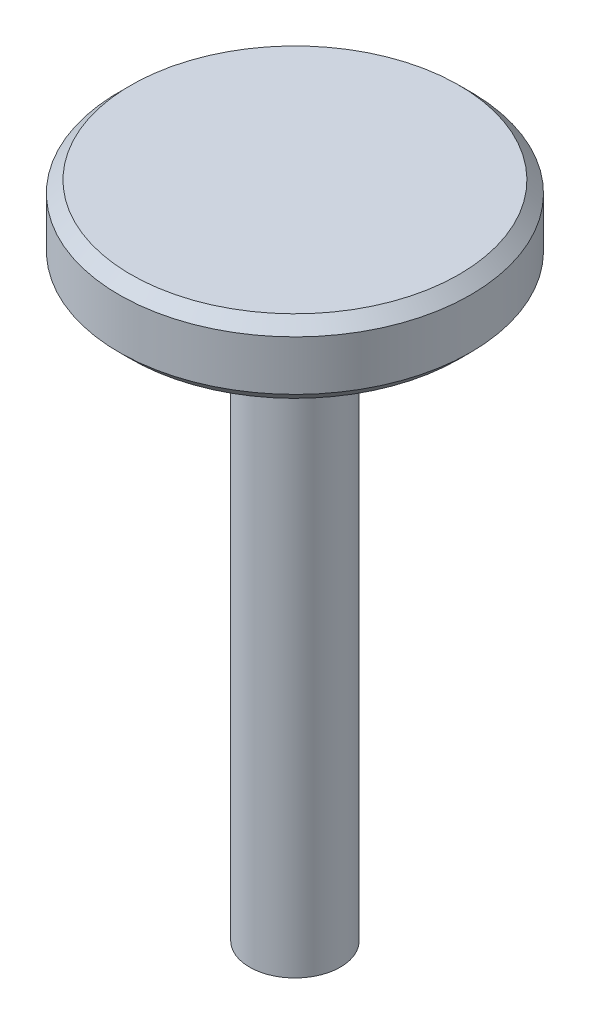
ISO-10303-21;
HEADER;
FILE_DESCRIPTION(('STEP AP214'),'2;1');
FILE_NAME('part.step','',(''),(''),'','','');
FILE_SCHEMA(('AUTOMOTIVE_DESIGN { 1 0 10303 214 1 1 1 1 }'));
ENDSEC;
DATA;
#1=APPLICATION_CONTEXT('core data for automotive mechanical design processes');
#2=APPLICATION_PROTOCOL_DEFINITION('international standard','automotive_design',2000,#1);
#3=PRODUCT_CONTEXT('',#1,'mechanical');
#4=PRODUCT('Part','Part','',(#3));
#5=PRODUCT_RELATED_PRODUCT_CATEGORY('part','',(#4));
#6=PRODUCT_DEFINITION_FORMATION('','',#4);
#7=PRODUCT_DEFINITION_CONTEXT('part definition',#1,'design');
#8=PRODUCT_DEFINITION('design','',#6,#7);
#9=PRODUCT_DEFINITION_SHAPE('','',#8);
#10=(LENGTH_UNIT() NAMED_UNIT(*) SI_UNIT(.MILLI.,.METRE.));
#11=(NAMED_UNIT(*) PLANE_ANGLE_UNIT() SI_UNIT($,.RADIAN.));
#12=(NAMED_UNIT(*) SI_UNIT($,.STERADIAN.) SOLID_ANGLE_UNIT());
#13=UNCERTAINTY_MEASURE_WITH_UNIT(LENGTH_MEASURE(1.E-05),#10,'distance_accuracy_value','');
#14=(GEOMETRIC_REPRESENTATION_CONTEXT(3) GLOBAL_UNCERTAINTY_ASSIGNED_CONTEXT((#13)) GLOBAL_UNIT_ASSIGNED_CONTEXT((#10,
#11,#12)) REPRESENTATION_CONTEXT('',''));
#15=CARTESIAN_POINT('',(0.,0.,0.));
#16=DIRECTION('',(0.,0.,1.));
#17=DIRECTION('',(1.,0.,0.));
#18=AXIS2_PLACEMENT_3D('',#15,#16,#17);
#19=CARTESIAN_POINT('',(-8.49999277070864,6.20044378023227,106.246990075042));
#20=DIRECTION('',(0.,1.,1.0071112731931E-13));
#21=DIRECTION('',(0.,1.0071112731931E-13,-1.));
#22=AXIS2_PLACEMENT_3D('',#19,#20,#21);
#23=PLANE('',#22);
#24=CARTESIAN_POINT('',(-8.49999277070864,6.20044378023227,106.246990075042));
#25=DIRECTION('',(0.,-1.,-1.0071112731931E-13));
#26=DIRECTION('',(-1.,0.,0.));
#27=AXIS2_PLACEMENT_3D('',#24,#25,#26);
#28=CIRCLE('',#27,1.55024047358084);
#29=CARTESIAN_POINT('',(-6.9497522971278,6.20044378023227,106.246990075042));
#30=VERTEX_POINT('',#29);
#31=EDGE_CURVE('E25',#30,#30,#28,.T.);
#32=ORIENTED_EDGE('',*,*,#31,.T.);
#33=EDGE_LOOP('',(#32));
#34=FACE_BOUND('',#33,.T.);
#35=ADVANCED_FACE('F16',(#34),#23,.F.);
#36=CARTESIAN_POINT('',(-8.49999277070872,26.2004437802323,106.246990075044));
#37=DIRECTION('',(0.,-1.,-1.00364161426114E-13));
#38=DIRECTION('',(-1.,0.,0.));
#39=AXIS2_PLACEMENT_3D('',#36,#37,#38);
#40=CYLINDRICAL_SURFACE('',#39,1.55024047358084);
#41=ORIENTED_EDGE('',*,*,#31,.F.);
#42=DIRECTION('',(0.,1.,1.00364161426114E-13));
#43=VECTOR('',#42,1.);
#44=CARTESIAN_POINT('',(-6.94975229712789,26.2004437802323,106.246990075044));
#45=LINE('',#44,#43);
#46=CARTESIAN_POINT('',(-6.94975229712789,26.2004437802323,106.246990075044));
#47=VERTEX_POINT('',#46);
#48=EDGE_CURVE('E11',#30,#47,#45,.T.);
#49=ORIENTED_EDGE('',*,*,#48,.T.);
#50=CARTESIAN_POINT('',(-8.49999277070872,26.2004437802323,106.246990075044));
#51=DIRECTION('',(0.,1.,1.0071112731931E-13));
#52=DIRECTION('',(-1.,0.,0.));
#53=AXIS2_PLACEMENT_3D('',#50,#51,#52);
#54=CIRCLE('',#53,1.55024047358084);
#55=EDGE_CURVE('E76',#47,#47,#54,.T.);
#56=ORIENTED_EDGE('',*,*,#55,.F.);
#57=ORIENTED_EDGE('',*,*,#48,.F.);
#58=EDGE_LOOP('',(#41,#49,#56,#57));
#59=FACE_BOUND('',#58,.T.);
#60=ADVANCED_FACE('F93',(#59),#40,.T.);
#61=CARTESIAN_POINT('',(-8.49999277070872,26.4004437802323,106.246990075044));
#62=DIRECTION('',(0.,1.,0.));
#63=DIRECTION('',(-1.,0.,0.));
#64=AXIS2_PLACEMENT_3D('',#61,#62,#63);
#65=CONICAL_SURFACE('',#64,5.8,0.78539816339746);
#66=CARTESIAN_POINT('',(-8.49999277070873,26.6004437802323,106.246990075044));
#67=DIRECTION('',(0.,-1.,-1.0071112731931E-13));
#68=DIRECTION('',(-1.,0.,0.));
#69=AXIS2_PLACEMENT_3D('',#66,#67,#68);
#70=CIRCLE('',#69,6.);
#71=CARTESIAN_POINT('',(-2.49999277070872,26.6004437802323,106.246990075044));
#72=VERTEX_POINT('',#71);
#73=EDGE_CURVE('E61',#72,#72,#70,.T.);
#74=ORIENTED_EDGE('',*,*,#73,.T.);
#75=DIRECTION('',(-0.707106781186552,-0.707106781186543,0.));
#76=VECTOR('',#75,1.);
#77=CARTESIAN_POINT('',(-2.69999277070872,26.4004437802323,106.246990075044));
#78=LINE('',#77,#76);
#79=CARTESIAN_POINT('',(-2.89999277070871,26.2004437802323,106.246990075044));
#80=VERTEX_POINT('',#79);
#81=EDGE_CURVE('E87',#72,#80,#78,.T.);
#82=ORIENTED_EDGE('',*,*,#81,.T.);
#83=CARTESIAN_POINT('',(-8.49999277070872,26.2004437802323,106.246990075044));
#84=DIRECTION('',(0.,1.,1.0071112731931E-13));
#85=DIRECTION('',(-1.,0.,0.));
#86=AXIS2_PLACEMENT_3D('',#83,#84,#85);
#87=CIRCLE('',#86,5.6);
#88=EDGE_CURVE('E79',#80,#80,#87,.T.);
#89=ORIENTED_EDGE('',*,*,#88,.T.);
#90=ORIENTED_EDGE('',*,*,#81,.F.);
#91=EDGE_LOOP('',(#74,#82,#89,#90));
#92=FACE_BOUND('',#91,.T.);
#93=ADVANCED_FACE('F101',(#92),#65,.T.);
#94=CARTESIAN_POINT('',(-8.49999277070873,28.7004437802323,106.246990075045));
#95=DIRECTION('',(0.,1.,1.0071112731931E-13));
#96=DIRECTION('',(0.,1.0071112731931E-13,-1.));
#97=AXIS2_PLACEMENT_3D('',#94,#95,#96);
#98=PLANE('',#97);
#99=CARTESIAN_POINT('',(-8.49999277070873,28.7004437802323,106.246990075045));
#100=DIRECTION('',(0.,-1.,-1.0071112731931E-13));
#101=DIRECTION('',(-1.,0.,0.));
#102=AXIS2_PLACEMENT_3D('',#99,#100,#101);
#103=CIRCLE('',#102,5.6);
#104=CARTESIAN_POINT('',(-2.89999277070873,28.7004437802323,106.246990075045));
#105=VERTEX_POINT('',#104);
#106=EDGE_CURVE('E73',#105,#105,#103,.T.);
#107=ORIENTED_EDGE('',*,*,#106,.F.);
#108=EDGE_LOOP('',(#107));
#109=FACE_BOUND('',#108,.T.);
#110=ADVANCED_FACE('F103',(#109),#98,.T.);
#111=CARTESIAN_POINT('',(-8.49999277070872,26.2004437802323,106.246990075044));
#112=DIRECTION('',(0.,1.,0.));
#113=DIRECTION('',(-1.,0.,0.));
#114=AXIS2_PLACEMENT_3D('',#111,#112,#113);
#115=CYLINDRICAL_SURFACE('',#114,6.);
#116=CARTESIAN_POINT('',(-8.49999277070873,28.3004437802322,106.246990075045));
#117=DIRECTION('',(0.,1.,1.0071112731931E-13));
#118=DIRECTION('',(-1.,0.,0.));
#119=AXIS2_PLACEMENT_3D('',#116,#117,#118);
#120=CIRCLE('',#119,6.);
#121=CARTESIAN_POINT('',(-2.49999277070872,28.3004437802323,106.246990075045));
#122=VERTEX_POINT('',#121);
#123=EDGE_CURVE('E58',#122,#122,#120,.T.);
#124=ORIENTED_EDGE('',*,*,#123,.F.);
#125=DIRECTION('',(0.,-1.,0.));
#126=VECTOR('',#125,1.);
#127=CARTESIAN_POINT('',(-2.49999277070871,26.2004437802323,106.246990075044));
#128=LINE('',#127,#126);
#129=EDGE_CURVE('E55',#122,#72,#128,.T.);
#130=ORIENTED_EDGE('',*,*,#129,.T.);
#131=ORIENTED_EDGE('',*,*,#73,.F.);
#132=ORIENTED_EDGE('',*,*,#129,.F.);
#133=EDGE_LOOP('',(#124,#130,#131,#132));
#134=FACE_BOUND('',#133,.T.);
#135=ADVANCED_FACE('F57',(#134),#115,.T.);
#136=CARTESIAN_POINT('',(-8.49999277070873,28.5004437802323,106.246990075045));
#137=DIRECTION('',(0.,-1.,0.));
#138=DIRECTION('',(-1.,0.,0.));
#139=AXIS2_PLACEMENT_3D('',#136,#137,#138);
#140=CONICAL_SURFACE('',#139,5.8,0.785398163397436);
#141=ORIENTED_EDGE('',*,*,#106,.T.);
#142=DIRECTION('',(0.707106781186543,-0.707106781186552,0.));
#143=VECTOR('',#142,1.);
#144=CARTESIAN_POINT('',(-2.69999277070872,28.5004437802323,106.246990075045));
#145=LINE('',#144,#143);
#146=EDGE_CURVE('E67',#105,#122,#145,.T.);
#147=ORIENTED_EDGE('',*,*,#146,.T.);
#148=ORIENTED_EDGE('',*,*,#123,.T.);
#149=ORIENTED_EDGE('',*,*,#146,.F.);
#150=EDGE_LOOP('',(#141,#147,#148,#149));
#151=FACE_BOUND('',#150,.T.);
#152=ADVANCED_FACE('F66',(#151),#140,.T.);
#153=CARTESIAN_POINT('',(-8.49999277070872,26.2004437802323,106.246990075044));
#154=DIRECTION('',(0.,1.,1.0071112731931E-13));
#155=DIRECTION('',(0.,1.0071112731931E-13,-1.));
#156=AXIS2_PLACEMENT_3D('',#153,#154,#155);
#157=PLANE('',#156);
#158=ORIENTED_EDGE('',*,*,#55,.T.);
#159=EDGE_LOOP('',(#158));
#160=FACE_BOUND('',#159,.T.);
#161=ORIENTED_EDGE('',*,*,#88,.F.);
#162=EDGE_LOOP('',(#161));
#163=FACE_BOUND('',#162,.T.);
#164=ADVANCED_FACE('F95',(#160,#163),#157,.F.);
#165=CLOSED_SHELL('',(#35,#60,#93,#110,#135,#152,#164));
#166=MANIFOLD_SOLID_BREP('B1',#165);
#167=ADVANCED_BREP_SHAPE_REPRESENTATION('',(#18,#166),#14);
#168=SHAPE_DEFINITION_REPRESENTATION(#9,#167);
ENDSEC;
END-ISO-10303-21;
